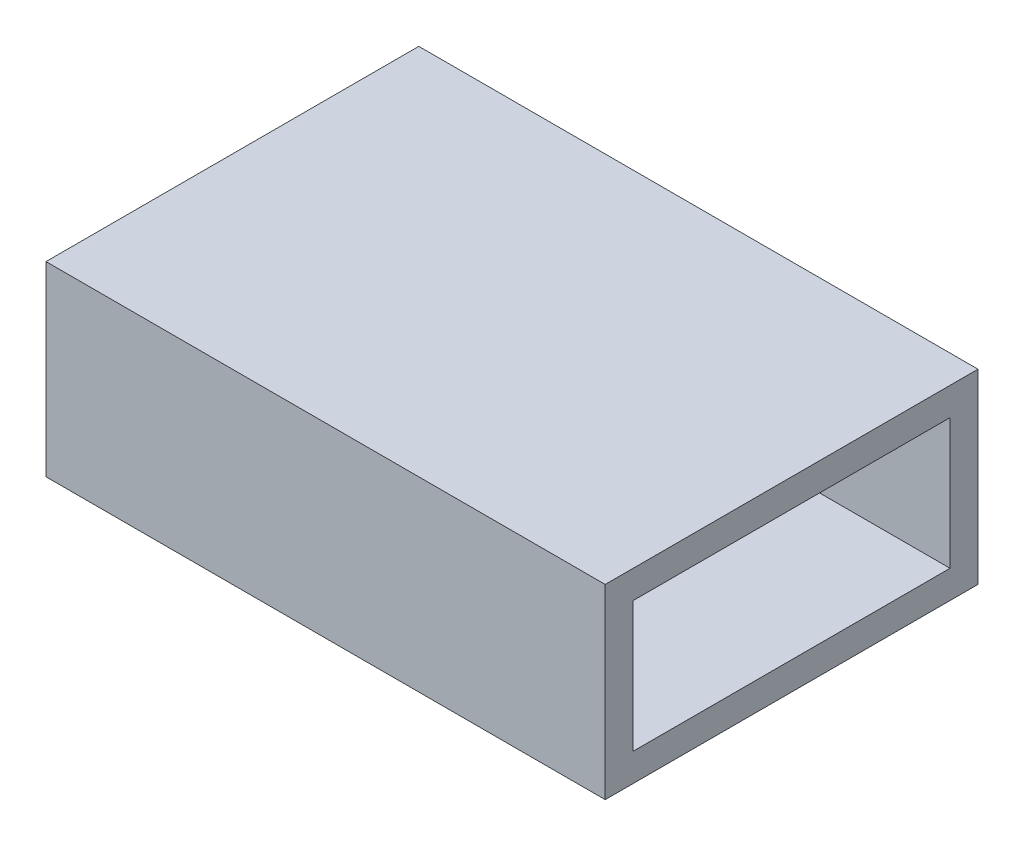
ISO-10303-21;
HEADER;
FILE_DESCRIPTION(('STEP AP214'),'2;1');
FILE_NAME('part.step','',(''),(''),'','','');
FILE_SCHEMA(('AUTOMOTIVE_DESIGN { 1 0 10303 214 1 1 1 1 }'));
ENDSEC;
DATA;
#1=APPLICATION_CONTEXT('core data for automotive mechanical design processes');
#2=APPLICATION_PROTOCOL_DEFINITION('international standard','automotive_design',2000,#1);
#3=PRODUCT_CONTEXT('',#1,'mechanical');
#4=PRODUCT('Part','Part','',(#3));
#5=PRODUCT_RELATED_PRODUCT_CATEGORY('part','',(#4));
#6=PRODUCT_DEFINITION_FORMATION('','',#4);
#7=PRODUCT_DEFINITION_CONTEXT('part definition',#1,'design');
#8=PRODUCT_DEFINITION('design','',#6,#7);
#9=PRODUCT_DEFINITION_SHAPE('','',#8);
#10=(LENGTH_UNIT() NAMED_UNIT(*) SI_UNIT(.MILLI.,.METRE.));
#11=(NAMED_UNIT(*) PLANE_ANGLE_UNIT() SI_UNIT($,.RADIAN.));
#12=(NAMED_UNIT(*) SI_UNIT($,.STERADIAN.) SOLID_ANGLE_UNIT());
#13=UNCERTAINTY_MEASURE_WITH_UNIT(LENGTH_MEASURE(1.E-05),#10,'distance_accuracy_value','');
#14=(GEOMETRIC_REPRESENTATION_CONTEXT(3) GLOBAL_UNCERTAINTY_ASSIGNED_CONTEXT((#13)) GLOBAL_UNIT_ASSIGNED_CONTEXT((#10,
#11,#12)) REPRESENTATION_CONTEXT('',''));
#15=CARTESIAN_POINT('',(0.,0.,0.));
#16=DIRECTION('',(0.,0.,1.));
#17=DIRECTION('',(1.,0.,0.));
#18=AXIS2_PLACEMENT_3D('',#15,#16,#17);
#19=CARTESIAN_POINT('',(30.,0.,0.));
#20=DIRECTION('',(1.,0.,0.));
#21=DIRECTION('',(0.,0.,-1.));
#22=AXIS2_PLACEMENT_3D('',#19,#20,#21);
#23=PLANE('',#22);
#24=DIRECTION('',(0.,1.,0.));
#25=VECTOR('',#24,1.);
#26=CARTESIAN_POINT('',(30.,5.,-10.));
#27=LINE('',#26,#25);
#28=CARTESIAN_POINT('',(30.,-5.,-10.));
#29=VERTEX_POINT('',#28);
#30=CARTESIAN_POINT('',(30.,5.,-10.));
#31=VERTEX_POINT('',#30);
#32=EDGE_CURVE('E134',#29,#31,#27,.T.);
#33=ORIENTED_EDGE('',*,*,#32,.T.);
#34=DIRECTION('',(0.,0.,1.));
#35=VECTOR('',#34,1.);
#36=CARTESIAN_POINT('',(30.,5.,10.));
#37=LINE('',#36,#35);
#38=CARTESIAN_POINT('',(30.,5.,10.));
#39=VERTEX_POINT('',#38);
#40=EDGE_CURVE('E137',#31,#39,#37,.T.);
#41=ORIENTED_EDGE('',*,*,#40,.T.);
#42=DIRECTION('',(0.,-1.,0.));
#43=VECTOR('',#42,1.);
#44=CARTESIAN_POINT('',(30.,5.,10.));
#45=LINE('',#44,#43);
#46=CARTESIAN_POINT('',(30.,-5.,10.));
#47=VERTEX_POINT('',#46);
#48=EDGE_CURVE('E140',#39,#47,#45,.T.);
#49=ORIENTED_EDGE('',*,*,#48,.T.);
#50=DIRECTION('',(0.,0.,-1.));
#51=VECTOR('',#50,1.);
#52=CARTESIAN_POINT('',(30.,-5.,10.));
#53=LINE('',#52,#51);
#54=EDGE_CURVE('E142',#47,#29,#53,.T.);
#55=ORIENTED_EDGE('',*,*,#54,.T.);
#56=EDGE_LOOP('',(#33,#41,#49,#55));
#57=FACE_BOUND('',#56,.T.);
#58=DIRECTION('',(0.,0.,-1.));
#59=VECTOR('',#58,1.);
#60=CARTESIAN_POINT('',(30.,-3.5,8.5));
#61=LINE('',#60,#59);
#62=CARTESIAN_POINT('',(30.,-3.5,8.5));
#63=VERTEX_POINT('',#62);
#64=CARTESIAN_POINT('',(30.,-3.5,-8.5));
#65=VERTEX_POINT('',#64);
#66=EDGE_CURVE('E106',#63,#65,#61,.T.);
#67=ORIENTED_EDGE('',*,*,#66,.F.);
#68=DIRECTION('',(0.,-1.,0.));
#69=VECTOR('',#68,1.);
#70=CARTESIAN_POINT('',(30.,3.5,8.5));
#71=LINE('',#70,#69);
#72=CARTESIAN_POINT('',(30.,3.5,8.5));
#73=VERTEX_POINT('',#72);
#74=EDGE_CURVE('E98',#73,#63,#71,.T.);
#75=ORIENTED_EDGE('',*,*,#74,.F.);
#76=DIRECTION('',(0.,0.,1.));
#77=VECTOR('',#76,1.);
#78=CARTESIAN_POINT('',(30.,3.5,8.5));
#79=LINE('',#78,#77);
#80=CARTESIAN_POINT('',(30.,3.5,-8.5));
#81=VERTEX_POINT('',#80);
#82=EDGE_CURVE('E120',#81,#73,#79,.T.);
#83=ORIENTED_EDGE('',*,*,#82,.F.);
#84=DIRECTION('',(0.,1.,0.));
#85=VECTOR('',#84,1.);
#86=CARTESIAN_POINT('',(30.,3.5,-8.5));
#87=LINE('',#86,#85);
#88=EDGE_CURVE('E118',#65,#81,#87,.T.);
#89=ORIENTED_EDGE('',*,*,#88,.F.);
#90=EDGE_LOOP('',(#67,#75,#83,#89));
#91=FACE_BOUND('',#90,.T.);
#92=ADVANCED_FACE('F33',(#57,#91),#23,.T.);
#93=CARTESIAN_POINT('',(0.,0.,0.));
#94=DIRECTION('',(1.,0.,0.));
#95=DIRECTION('',(0.,0.,-1.));
#96=AXIS2_PLACEMENT_3D('',#93,#94,#95);
#97=PLANE('',#96);
#98=DIRECTION('',(0.,1.,0.));
#99=VECTOR('',#98,1.);
#100=CARTESIAN_POINT('',(0.,5.,-10.));
#101=LINE('',#100,#99);
#102=CARTESIAN_POINT('',(0.,-5.,-10.));
#103=VERTEX_POINT('',#102);
#104=CARTESIAN_POINT('',(0.,5.,-10.));
#105=VERTEX_POINT('',#104);
#106=EDGE_CURVE('E114',#103,#105,#101,.T.);
#107=ORIENTED_EDGE('',*,*,#106,.F.);
#108=DIRECTION('',(0.,0.,-1.));
#109=VECTOR('',#108,1.);
#110=CARTESIAN_POINT('',(0.,-5.,10.));
#111=LINE('',#110,#109);
#112=CARTESIAN_POINT('',(0.,-5.,10.));
#113=VERTEX_POINT('',#112);
#114=EDGE_CURVE('E138',#113,#103,#111,.T.);
#115=ORIENTED_EDGE('',*,*,#114,.F.);
#116=DIRECTION('',(0.,-1.,0.));
#117=VECTOR('',#116,1.);
#118=CARTESIAN_POINT('',(0.,5.,10.));
#119=LINE('',#118,#117);
#120=CARTESIAN_POINT('',(0.,5.,10.));
#121=VERTEX_POINT('',#120);
#122=EDGE_CURVE('E149',#121,#113,#119,.T.);
#123=ORIENTED_EDGE('',*,*,#122,.F.);
#124=DIRECTION('',(0.,0.,1.));
#125=VECTOR('',#124,1.);
#126=CARTESIAN_POINT('',(0.,5.,10.));
#127=LINE('',#126,#125);
#128=EDGE_CURVE('E147',#105,#121,#127,.T.);
#129=ORIENTED_EDGE('',*,*,#128,.F.);
#130=EDGE_LOOP('',(#107,#115,#123,#129));
#131=FACE_BOUND('',#130,.T.);
#132=DIRECTION('',(0.,-1.,0.));
#133=VECTOR('',#132,1.);
#134=CARTESIAN_POINT('',(0.,3.5,8.5));
#135=LINE('',#134,#133);
#136=CARTESIAN_POINT('',(0.,3.5,8.5));
#137=VERTEX_POINT('',#136);
#138=CARTESIAN_POINT('',(0.,-3.5,8.5));
#139=VERTEX_POINT('',#138);
#140=EDGE_CURVE('E56',#137,#139,#135,.T.);
#141=ORIENTED_EDGE('',*,*,#140,.T.);
#142=DIRECTION('',(0.,0.,-1.));
#143=VECTOR('',#142,1.);
#144=CARTESIAN_POINT('',(0.,-3.5,8.5));
#145=LINE('',#144,#143);
#146=CARTESIAN_POINT('',(0.,-3.5,-8.5));
#147=VERTEX_POINT('',#146);
#148=EDGE_CURVE('E113',#139,#147,#145,.T.);
#149=ORIENTED_EDGE('',*,*,#148,.T.);
#150=DIRECTION('',(0.,1.,0.));
#151=VECTOR('',#150,1.);
#152=CARTESIAN_POINT('',(0.,3.5,-8.5));
#153=LINE('',#152,#151);
#154=CARTESIAN_POINT('',(0.,3.5,-8.5));
#155=VERTEX_POINT('',#154);
#156=EDGE_CURVE('E126',#147,#155,#153,.T.);
#157=ORIENTED_EDGE('',*,*,#156,.T.);
#158=DIRECTION('',(0.,0.,1.));
#159=VECTOR('',#158,1.);
#160=CARTESIAN_POINT('',(0.,3.5,8.5));
#161=LINE('',#160,#159);
#162=EDGE_CURVE('E107',#155,#137,#161,.T.);
#163=ORIENTED_EDGE('',*,*,#162,.T.);
#164=EDGE_LOOP('',(#141,#149,#157,#163));
#165=FACE_BOUND('',#164,.T.);
#166=ADVANCED_FACE('F167',(#131,#165),#97,.F.);
#167=CARTESIAN_POINT('',(30.,5.,-10.));
#168=DIRECTION('',(0.,0.,1.));
#169=DIRECTION('',(1.,0.,0.));
#170=AXIS2_PLACEMENT_3D('',#167,#168,#169);
#171=PLANE('',#170);
#172=ORIENTED_EDGE('',*,*,#106,.T.);
#173=DIRECTION('',(-1.,0.,0.));
#174=VECTOR('',#173,1.);
#175=CARTESIAN_POINT('',(30.,5.,-10.));
#176=LINE('',#175,#174);
#177=EDGE_CURVE('E11',#31,#105,#176,.T.);
#178=ORIENTED_EDGE('',*,*,#177,.F.);
#179=ORIENTED_EDGE('',*,*,#32,.F.);
#180=DIRECTION('',(-1.,0.,0.));
#181=VECTOR('',#180,1.);
#182=CARTESIAN_POINT('',(30.,-5.,-10.));
#183=LINE('',#182,#181);
#184=EDGE_CURVE('E144',#29,#103,#183,.T.);
#185=ORIENTED_EDGE('',*,*,#184,.T.);
#186=EDGE_LOOP('',(#172,#178,#179,#185));
#187=FACE_BOUND('',#186,.T.);
#188=ADVANCED_FACE('F35',(#187),#171,.F.);
#189=CARTESIAN_POINT('',(30.,5.,10.));
#190=DIRECTION('',(0.,-1.,0.));
#191=DIRECTION('',(0.,0.,-1.));
#192=AXIS2_PLACEMENT_3D('',#189,#190,#191);
#193=PLANE('',#192);
#194=ORIENTED_EDGE('',*,*,#128,.T.);
#195=DIRECTION('',(-1.,0.,0.));
#196=VECTOR('',#195,1.);
#197=CARTESIAN_POINT('',(30.,5.,10.));
#198=LINE('',#197,#196);
#199=EDGE_CURVE('E41',#39,#121,#198,.T.);
#200=ORIENTED_EDGE('',*,*,#199,.F.);
#201=ORIENTED_EDGE('',*,*,#40,.F.);
#202=ORIENTED_EDGE('',*,*,#177,.T.);
#203=EDGE_LOOP('',(#194,#200,#201,#202));
#204=FACE_BOUND('',#203,.T.);
#205=ADVANCED_FACE('F177',(#204),#193,.F.);
#206=CARTESIAN_POINT('',(30.,5.,10.));
#207=DIRECTION('',(0.,0.,-1.));
#208=DIRECTION('',(0.,1.,0.));
#209=AXIS2_PLACEMENT_3D('',#206,#207,#208);
#210=PLANE('',#209);
#211=ORIENTED_EDGE('',*,*,#122,.T.);
#212=DIRECTION('',(-1.,0.,0.));
#213=VECTOR('',#212,1.);
#214=CARTESIAN_POINT('',(30.,-5.,10.));
#215=LINE('',#214,#213);
#216=EDGE_CURVE('E154',#47,#113,#215,.T.);
#217=ORIENTED_EDGE('',*,*,#216,.F.);
#218=ORIENTED_EDGE('',*,*,#48,.F.);
#219=ORIENTED_EDGE('',*,*,#199,.T.);
#220=EDGE_LOOP('',(#211,#217,#218,#219));
#221=FACE_BOUND('',#220,.T.);
#222=ADVANCED_FACE('F161',(#221),#210,.F.);
#223=CARTESIAN_POINT('',(30.,-5.,10.));
#224=DIRECTION('',(0.,1.,0.));
#225=DIRECTION('',(0.,0.,1.));
#226=AXIS2_PLACEMENT_3D('',#223,#224,#225);
#227=PLANE('',#226);
#228=ORIENTED_EDGE('',*,*,#114,.T.);
#229=ORIENTED_EDGE('',*,*,#184,.F.);
#230=ORIENTED_EDGE('',*,*,#54,.F.);
#231=ORIENTED_EDGE('',*,*,#216,.T.);
#232=EDGE_LOOP('',(#228,#229,#230,#231));
#233=FACE_BOUND('',#232,.T.);
#234=ADVANCED_FACE('F171',(#233),#227,.F.);
#235=CARTESIAN_POINT('',(30.,3.5,8.5));
#236=DIRECTION('',(0.,0.,-1.));
#237=DIRECTION('',(0.,1.,0.));
#238=AXIS2_PLACEMENT_3D('',#235,#236,#237);
#239=PLANE('',#238);
#240=ORIENTED_EDGE('',*,*,#140,.F.);
#241=DIRECTION('',(-1.,0.,0.));
#242=VECTOR('',#241,1.);
#243=CARTESIAN_POINT('',(30.,3.5,8.5));
#244=LINE('',#243,#242);
#245=EDGE_CURVE('E102',#73,#137,#244,.T.);
#246=ORIENTED_EDGE('',*,*,#245,.F.);
#247=ORIENTED_EDGE('',*,*,#74,.T.);
#248=DIRECTION('',(-1.,0.,0.));
#249=VECTOR('',#248,1.);
#250=CARTESIAN_POINT('',(30.,-3.5,8.5));
#251=LINE('',#250,#249);
#252=EDGE_CURVE('E101',#63,#139,#251,.T.);
#253=ORIENTED_EDGE('',*,*,#252,.T.);
#254=EDGE_LOOP('',(#240,#246,#247,#253));
#255=FACE_BOUND('',#254,.T.);
#256=ADVANCED_FACE('F100',(#255),#239,.T.);
#257=CARTESIAN_POINT('',(30.,-3.5,8.5));
#258=DIRECTION('',(0.,1.,0.));
#259=DIRECTION('',(0.,0.,1.));
#260=AXIS2_PLACEMENT_3D('',#257,#258,#259);
#261=PLANE('',#260);
#262=ORIENTED_EDGE('',*,*,#148,.F.);
#263=ORIENTED_EDGE('',*,*,#252,.F.);
#264=ORIENTED_EDGE('',*,*,#66,.T.);
#265=DIRECTION('',(-1.,0.,0.));
#266=VECTOR('',#265,1.);
#267=CARTESIAN_POINT('',(30.,-3.5,-8.5));
#268=LINE('',#267,#266);
#269=EDGE_CURVE('E115',#65,#147,#268,.T.);
#270=ORIENTED_EDGE('',*,*,#269,.T.);
#271=EDGE_LOOP('',(#262,#263,#264,#270));
#272=FACE_BOUND('',#271,.T.);
#273=ADVANCED_FACE('F110',(#272),#261,.T.);
#274=CARTESIAN_POINT('',(30.,3.5,-8.5));
#275=DIRECTION('',(0.,0.,1.));
#276=DIRECTION('',(1.,0.,0.));
#277=AXIS2_PLACEMENT_3D('',#274,#275,#276);
#278=PLANE('',#277);
#279=ORIENTED_EDGE('',*,*,#156,.F.);
#280=ORIENTED_EDGE('',*,*,#269,.F.);
#281=ORIENTED_EDGE('',*,*,#88,.T.);
#282=DIRECTION('',(-1.,0.,0.));
#283=VECTOR('',#282,1.);
#284=CARTESIAN_POINT('',(30.,3.5,-8.5));
#285=LINE('',#284,#283);
#286=EDGE_CURVE('E48',#81,#155,#285,.T.);
#287=ORIENTED_EDGE('',*,*,#286,.T.);
#288=EDGE_LOOP('',(#279,#280,#281,#287));
#289=FACE_BOUND('',#288,.T.);
#290=ADVANCED_FACE('F200',(#289),#278,.T.);
#291=CARTESIAN_POINT('',(30.,3.5,8.5));
#292=DIRECTION('',(0.,-1.,0.));
#293=DIRECTION('',(0.,0.,-1.));
#294=AXIS2_PLACEMENT_3D('',#291,#292,#293);
#295=PLANE('',#294);
#296=ORIENTED_EDGE('',*,*,#162,.F.);
#297=ORIENTED_EDGE('',*,*,#286,.F.);
#298=ORIENTED_EDGE('',*,*,#82,.T.);
#299=ORIENTED_EDGE('',*,*,#245,.T.);
#300=EDGE_LOOP('',(#296,#297,#298,#299));
#301=FACE_BOUND('',#300,.T.);
#302=ADVANCED_FACE('F204',(#301),#295,.T.);
#303=CLOSED_SHELL('',(#92,#166,#188,#205,#222,#234,#256,#273,#290,#302));
#304=MANIFOLD_SOLID_BREP('B2',#303);
#305=ADVANCED_BREP_SHAPE_REPRESENTATION('',(#18,#304),#14);
#306=SHAPE_DEFINITION_REPRESENTATION(#9,#305);
ENDSEC;
END-ISO-10303-21;
